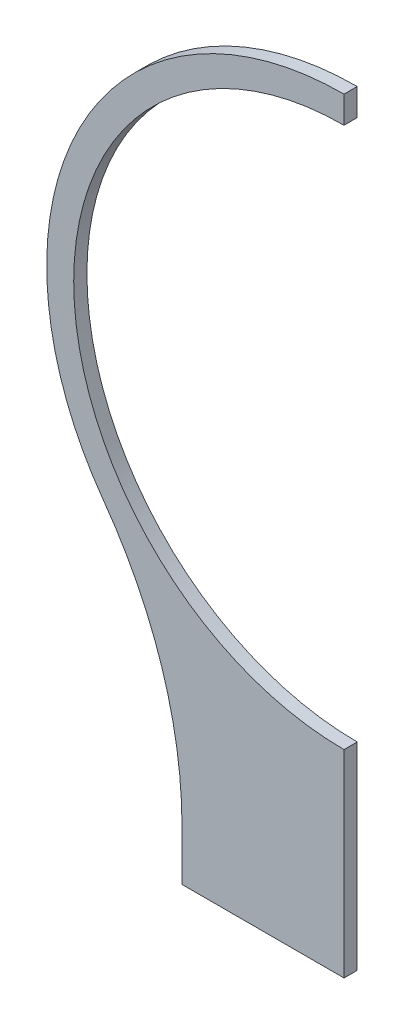
ISO-10303-21;
HEADER;
FILE_DESCRIPTION(('STEP AP214'),'2;1');
FILE_NAME('part.step','',(''),(''),'','','');
FILE_SCHEMA(('AUTOMOTIVE_DESIGN { 1 0 10303 214 1 1 1 1 }'));
ENDSEC;
DATA;
#1=APPLICATION_CONTEXT('core data for automotive mechanical design processes');
#2=APPLICATION_PROTOCOL_DEFINITION('international standard','automotive_design',2000,#1);
#3=PRODUCT_CONTEXT('',#1,'mechanical');
#4=PRODUCT('Part','Part','',(#3));
#5=PRODUCT_RELATED_PRODUCT_CATEGORY('part','',(#4));
#6=PRODUCT_DEFINITION_FORMATION('','',#4);
#7=PRODUCT_DEFINITION_CONTEXT('part definition',#1,'design');
#8=PRODUCT_DEFINITION('design','',#6,#7);
#9=PRODUCT_DEFINITION_SHAPE('','',#8);
#10=(LENGTH_UNIT() NAMED_UNIT(*) SI_UNIT(.MILLI.,.METRE.));
#11=(NAMED_UNIT(*) PLANE_ANGLE_UNIT() SI_UNIT($,.RADIAN.));
#12=(NAMED_UNIT(*) SI_UNIT($,.STERADIAN.) SOLID_ANGLE_UNIT());
#13=UNCERTAINTY_MEASURE_WITH_UNIT(LENGTH_MEASURE(1.E-05),#10,'distance_accuracy_value','');
#14=(GEOMETRIC_REPRESENTATION_CONTEXT(3) GLOBAL_UNCERTAINTY_ASSIGNED_CONTEXT((#13)) GLOBAL_UNIT_ASSIGNED_CONTEXT((#10,
#11,#12)) REPRESENTATION_CONTEXT('',''));
#15=CARTESIAN_POINT('',(0.,0.,0.));
#16=DIRECTION('',(0.,0.,1.));
#17=DIRECTION('',(1.,0.,0.));
#18=AXIS2_PLACEMENT_3D('',#15,#16,#17);
#19=CARTESIAN_POINT('',(-277.925699060751,-201.019170264537,6.35));
#20=DIRECTION('',(0.,0.,-1.));
#21=DIRECTION('',(-1.,0.,0.));
#22=AXIS2_PLACEMENT_3D('',#19,#20,#21);
#23=CYLINDRICAL_SURFACE('',#22,200.);
#24=CARTESIAN_POINT('',(-277.925699060751,-201.019170264537,0.));
#25=DIRECTION('',(0.,0.,-1.));
#26=DIRECTION('',(-1.,0.,0.));
#27=AXIS2_PLACEMENT_3D('',#24,#25,#26);
#28=CIRCLE('',#27,200.);
#29=CARTESIAN_POINT('',(-115.871551472898,-83.8080221190885,0.));
#30=VERTEX_POINT('',#29);
#31=CARTESIAN_POINT('',(-77.9256990607507,-201.019170264537,0.));
#32=VERTEX_POINT('',#31);
#33=EDGE_CURVE('E121',#30,#32,#28,.T.);
#34=ORIENTED_EDGE('',*,*,#33,.T.);
#35=DIRECTION('',(0.,0.,-1.));
#36=VECTOR('',#35,1.);
#37=CARTESIAN_POINT('',(-77.9256990607507,-201.019170264537,6.35));
#38=LINE('',#37,#36);
#39=CARTESIAN_POINT('',(-77.9256990607507,-201.019170264537,6.35));
#40=VERTEX_POINT('',#39);
#41=EDGE_CURVE('E11',#40,#32,#38,.T.);
#42=ORIENTED_EDGE('',*,*,#41,.F.);
#43=CARTESIAN_POINT('',(-277.925699060751,-201.019170264537,6.35));
#44=DIRECTION('',(0.,0.,-1.));
#45=DIRECTION('',(-1.,0.,0.));
#46=AXIS2_PLACEMENT_3D('',#43,#44,#45);
#47=CIRCLE('',#46,200.);
#48=CARTESIAN_POINT('',(-115.871551472898,-83.8080221190885,6.35));
#49=VERTEX_POINT('',#48);
#50=EDGE_CURVE('E133',#49,#40,#47,.T.);
#51=ORIENTED_EDGE('',*,*,#50,.F.);
#52=DIRECTION('',(0.,0.,-1.));
#53=VECTOR('',#52,1.);
#54=CARTESIAN_POINT('',(-115.871551472898,-83.8080221190885,6.35));
#55=LINE('',#54,#53);
#56=EDGE_CURVE('E117',#49,#30,#55,.T.);
#57=ORIENTED_EDGE('',*,*,#56,.T.);
#58=EDGE_LOOP('',(#34,#42,#51,#57));
#59=FACE_BOUND('',#58,.T.);
#60=ADVANCED_FACE('F31',(#59),#23,.F.);
#61=CARTESIAN_POINT('',(-77.9256990607507,-225.171,6.35));
#62=DIRECTION('',(1.,0.,0.));
#63=DIRECTION('',(0.,1.,0.));
#64=AXIS2_PLACEMENT_3D('',#61,#62,#63);
#65=PLANE('',#64);
#66=DIRECTION('',(0.,-1.,0.));
#67=VECTOR('',#66,1.);
#68=CARTESIAN_POINT('',(-77.9256990607507,-225.171,0.));
#69=LINE('',#68,#67);
#70=CARTESIAN_POINT('',(-77.9256990607507,-225.171,0.));
#71=VERTEX_POINT('',#70);
#72=EDGE_CURVE('E124',#32,#71,#69,.T.);
#73=ORIENTED_EDGE('',*,*,#72,.T.);
#74=DIRECTION('',(0.,0.,-1.));
#75=VECTOR('',#74,1.);
#76=CARTESIAN_POINT('',(-77.9256990607507,-225.171,6.35));
#77=LINE('',#76,#75);
#78=CARTESIAN_POINT('',(-77.9256990607507,-225.171,6.35));
#79=VERTEX_POINT('',#78);
#80=EDGE_CURVE('E39',#79,#71,#77,.T.);
#81=ORIENTED_EDGE('',*,*,#80,.F.);
#82=DIRECTION('',(0.,-1.,0.));
#83=VECTOR('',#82,1.);
#84=CARTESIAN_POINT('',(-77.9256990607507,-225.171,6.35));
#85=LINE('',#84,#83);
#86=EDGE_CURVE('E87',#40,#79,#85,.T.);
#87=ORIENTED_EDGE('',*,*,#86,.F.);
#88=ORIENTED_EDGE('',*,*,#41,.T.);
#89=EDGE_LOOP('',(#73,#81,#87,#88));
#90=FACE_BOUND('',#89,.T.);
#91=ADVANCED_FACE('F158',(#90),#65,.F.);
#92=CARTESIAN_POINT('',(0.,-225.171,6.35));
#93=DIRECTION('',(0.,1.,0.));
#94=DIRECTION('',(0.,0.,1.));
#95=AXIS2_PLACEMENT_3D('',#92,#93,#94);
#96=PLANE('',#95);
#97=DIRECTION('',(1.,0.,0.));
#98=VECTOR('',#97,1.);
#99=CARTESIAN_POINT('',(0.,-225.171,0.));
#100=LINE('',#99,#98);
#101=CARTESIAN_POINT('',(0.,-225.171,0.));
#102=VERTEX_POINT('',#101);
#103=EDGE_CURVE('E126',#71,#102,#100,.T.);
#104=ORIENTED_EDGE('',*,*,#103,.T.);
#105=DIRECTION('',(0.,0.,-1.));
#106=VECTOR('',#105,1.);
#107=CARTESIAN_POINT('',(0.,-225.171,6.35));
#108=LINE('',#107,#106);
#109=CARTESIAN_POINT('',(0.,-225.171,6.35));
#110=VERTEX_POINT('',#109);
#111=EDGE_CURVE('E137',#110,#102,#108,.T.);
#112=ORIENTED_EDGE('',*,*,#111,.F.);
#113=DIRECTION('',(1.,0.,0.));
#114=VECTOR('',#113,1.);
#115=CARTESIAN_POINT('',(0.,-225.171,6.35));
#116=LINE('',#115,#114);
#117=EDGE_CURVE('E145',#79,#110,#116,.T.);
#118=ORIENTED_EDGE('',*,*,#117,.F.);
#119=ORIENTED_EDGE('',*,*,#80,.T.);
#120=EDGE_LOOP('',(#104,#112,#118,#119));
#121=FACE_BOUND('',#120,.T.);
#122=ADVANCED_FACE('F143',(#121),#96,.F.);
#123=CARTESIAN_POINT('',(0.,-130.023,6.35));
#124=DIRECTION('',(-1.,0.,0.));
#125=DIRECTION('',(0.,0.,1.));
#126=AXIS2_PLACEMENT_3D('',#123,#124,#125);
#127=PLANE('',#126);
#128=DIRECTION('',(0.,1.,0.));
#129=VECTOR('',#128,1.);
#130=CARTESIAN_POINT('',(0.,-130.023,0.));
#131=LINE('',#130,#129);
#132=CARTESIAN_POINT('',(0.,-130.023,0.));
#133=VERTEX_POINT('',#132);
#134=EDGE_CURVE('E128',#102,#133,#131,.T.);
#135=ORIENTED_EDGE('',*,*,#134,.T.);
#136=DIRECTION('',(0.,0.,-1.));
#137=VECTOR('',#136,1.);
#138=CARTESIAN_POINT('',(0.,-130.023,6.35));
#139=LINE('',#138,#137);
#140=CARTESIAN_POINT('',(0.,-130.023,6.35));
#141=VERTEX_POINT('',#140);
#142=EDGE_CURVE('E112',#141,#133,#139,.T.);
#143=ORIENTED_EDGE('',*,*,#142,.F.);
#144=DIRECTION('',(0.,1.,0.));
#145=VECTOR('',#144,1.);
#146=CARTESIAN_POINT('',(0.,-130.023,6.35));
#147=LINE('',#146,#145);
#148=EDGE_CURVE('E103',#110,#141,#147,.T.);
#149=ORIENTED_EDGE('',*,*,#148,.F.);
#150=ORIENTED_EDGE('',*,*,#111,.T.);
#151=EDGE_LOOP('',(#135,#143,#149,#150));
#152=FACE_BOUND('',#151,.T.);
#153=ADVANCED_FACE('F151',(#152),#127,.F.);
#154=CARTESIAN_POINT('',(0.,0.,6.35));
#155=DIRECTION('',(0.,0.,-1.));
#156=DIRECTION('',(-1.,0.,0.));
#157=AXIS2_PLACEMENT_3D('',#154,#155,#156);
#158=CYLINDRICAL_SURFACE('',#157,130.023);
#159=CARTESIAN_POINT('',(0.,0.,0.));
#160=DIRECTION('',(0.,0.,-1.));
#161=DIRECTION('',(1.,0.,0.));
#162=AXIS2_PLACEMENT_3D('',#159,#160,#161);
#163=CIRCLE('',#162,130.023);
#164=CARTESIAN_POINT('',(0.,130.023,0.));
#165=VERTEX_POINT('',#164);
#166=EDGE_CURVE('E111',#133,#165,#163,.T.);
#167=ORIENTED_EDGE('',*,*,#166,.T.);
#168=DIRECTION('',(0.,0.,-1.));
#169=VECTOR('',#168,1.);
#170=CARTESIAN_POINT('',(0.,130.023,6.35));
#171=LINE('',#170,#169);
#172=CARTESIAN_POINT('',(0.,130.023,6.35));
#173=VERTEX_POINT('',#172);
#174=EDGE_CURVE('E108',#173,#165,#171,.T.);
#175=ORIENTED_EDGE('',*,*,#174,.F.);
#176=CARTESIAN_POINT('',(0.,0.,6.35));
#177=DIRECTION('',(0.,0.,-1.));
#178=DIRECTION('',(1.,0.,0.));
#179=AXIS2_PLACEMENT_3D('',#176,#177,#178);
#180=CIRCLE('',#179,130.023);
#181=EDGE_CURVE('E97',#141,#173,#180,.T.);
#182=ORIENTED_EDGE('',*,*,#181,.F.);
#183=ORIENTED_EDGE('',*,*,#142,.T.);
#184=EDGE_LOOP('',(#167,#175,#182,#183));
#185=FACE_BOUND('',#184,.T.);
#186=ADVANCED_FACE('F109',(#185),#158,.F.);
#187=CARTESIAN_POINT('',(0.,130.023,6.35));
#188=DIRECTION('',(-1.,0.,0.));
#189=DIRECTION('',(0.,0.,1.));
#190=AXIS2_PLACEMENT_3D('',#187,#188,#189);
#191=PLANE('',#190);
#192=DIRECTION('',(0.,1.,0.));
#193=VECTOR('',#192,1.);
#194=CARTESIAN_POINT('',(0.,130.023,0.));
#195=LINE('',#194,#193);
#196=CARTESIAN_POINT('',(0.,143.0035,0.));
#197=VERTEX_POINT('',#196);
#198=EDGE_CURVE('E73',#165,#197,#195,.T.);
#199=ORIENTED_EDGE('',*,*,#198,.T.);
#200=DIRECTION('',(0.,0.,-1.));
#201=VECTOR('',#200,1.);
#202=CARTESIAN_POINT('',(0.,143.0035,6.35));
#203=LINE('',#202,#201);
#204=CARTESIAN_POINT('',(0.,143.0035,6.35));
#205=VERTEX_POINT('',#204);
#206=EDGE_CURVE('E113',#205,#197,#203,.T.);
#207=ORIENTED_EDGE('',*,*,#206,.F.);
#208=DIRECTION('',(0.,1.,0.));
#209=VECTOR('',#208,1.);
#210=CARTESIAN_POINT('',(0.,130.023,6.35));
#211=LINE('',#210,#209);
#212=EDGE_CURVE('E101',#173,#205,#211,.T.);
#213=ORIENTED_EDGE('',*,*,#212,.F.);
#214=ORIENTED_EDGE('',*,*,#174,.T.);
#215=EDGE_LOOP('',(#199,#207,#213,#214));
#216=FACE_BOUND('',#215,.T.);
#217=ADVANCED_FACE('F115',(#216),#191,.F.);
#218=CARTESIAN_POINT('',(0.,0.,6.35));
#219=DIRECTION('',(0.,0.,-1.));
#220=DIRECTION('',(-1.,0.,0.));
#221=AXIS2_PLACEMENT_3D('',#218,#219,#220);
#222=CYLINDRICAL_SURFACE('',#221,143.0035);
#223=CARTESIAN_POINT('',(0.,0.,0.));
#224=DIRECTION('',(0.,0.,1.));
#225=DIRECTION('',(1.,0.,0.));
#226=AXIS2_PLACEMENT_3D('',#223,#224,#225);
#227=CIRCLE('',#226,143.0035);
#228=EDGE_CURVE('E79',#197,#30,#227,.T.);
#229=ORIENTED_EDGE('',*,*,#228,.T.);
#230=ORIENTED_EDGE('',*,*,#56,.F.);
#231=CARTESIAN_POINT('',(0.,0.,6.35));
#232=DIRECTION('',(0.,0.,1.));
#233=DIRECTION('',(1.,0.,0.));
#234=AXIS2_PLACEMENT_3D('',#231,#232,#233);
#235=CIRCLE('',#234,143.0035);
#236=EDGE_CURVE('E47',#205,#49,#235,.T.);
#237=ORIENTED_EDGE('',*,*,#236,.F.);
#238=ORIENTED_EDGE('',*,*,#206,.T.);
#239=EDGE_LOOP('',(#229,#230,#237,#238));
#240=FACE_BOUND('',#239,.T.);
#241=ADVANCED_FACE('F172',(#240),#222,.T.);
#242=CARTESIAN_POINT('',(-277.925699060751,-201.019170264537,6.35));
#243=DIRECTION('',(0.,0.,-1.));
#244=DIRECTION('',(-1.,0.,0.));
#245=AXIS2_PLACEMENT_3D('',#242,#243,#244);
#246=PLANE('',#245);
#247=ORIENTED_EDGE('',*,*,#50,.T.);
#248=ORIENTED_EDGE('',*,*,#86,.T.);
#249=ORIENTED_EDGE('',*,*,#117,.T.);
#250=ORIENTED_EDGE('',*,*,#148,.T.);
#251=ORIENTED_EDGE('',*,*,#181,.T.);
#252=ORIENTED_EDGE('',*,*,#212,.T.);
#253=ORIENTED_EDGE('',*,*,#236,.T.);
#254=EDGE_LOOP('',(#247,#248,#249,#250,#251,#252,#253));
#255=FACE_BOUND('',#254,.T.);
#256=ADVANCED_FACE('F99',(#255),#246,.F.);
#257=CARTESIAN_POINT('',(-277.925699060751,-201.019170264537,0.));
#258=DIRECTION('',(0.,0.,-1.));
#259=DIRECTION('',(-1.,0.,0.));
#260=AXIS2_PLACEMENT_3D('',#257,#258,#259);
#261=PLANE('',#260);
#262=ORIENTED_EDGE('',*,*,#33,.F.);
#263=ORIENTED_EDGE('',*,*,#228,.F.);
#264=ORIENTED_EDGE('',*,*,#198,.F.);
#265=ORIENTED_EDGE('',*,*,#166,.F.);
#266=ORIENTED_EDGE('',*,*,#134,.F.);
#267=ORIENTED_EDGE('',*,*,#103,.F.);
#268=ORIENTED_EDGE('',*,*,#72,.F.);
#269=EDGE_LOOP('',(#262,#263,#264,#265,#266,#267,#268));
#270=FACE_BOUND('',#269,.T.);
#271=ADVANCED_FACE('F149',(#270),#261,.T.);
#272=CLOSED_SHELL('',(#60,#91,#122,#153,#186,#217,#241,#256,#271));
#273=MANIFOLD_SOLID_BREP('B2',#272);
#274=ADVANCED_BREP_SHAPE_REPRESENTATION('',(#18,#273),#14);
#275=SHAPE_DEFINITION_REPRESENTATION(#9,#274);
ENDSEC;
END-ISO-10303-21;
